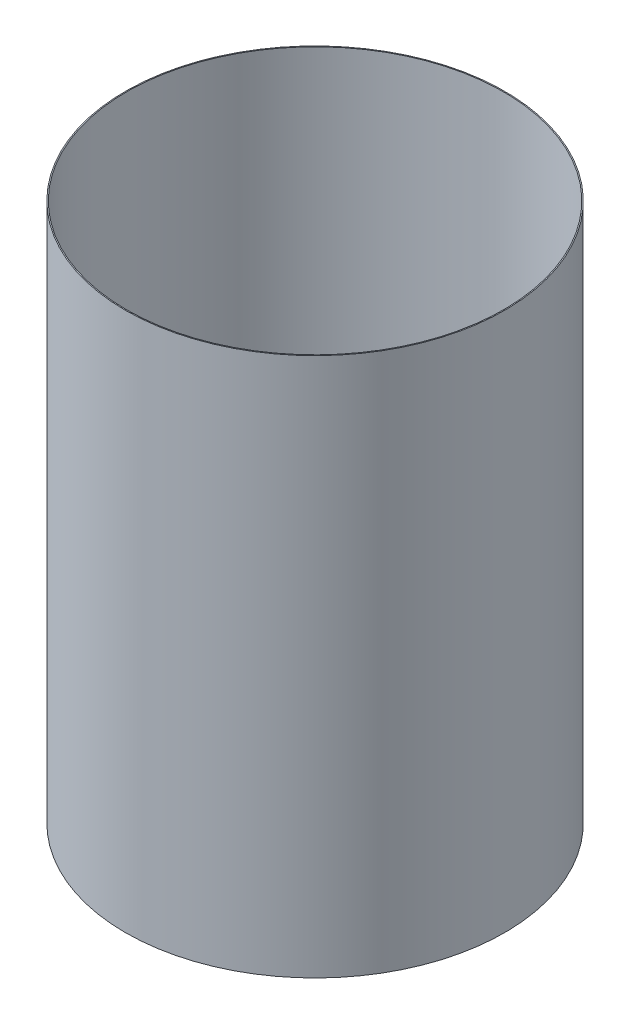
ISO-10303-21;
HEADER;
FILE_DESCRIPTION(('STEP AP214'),'2;1');
FILE_NAME('part.step','',(''),(''),'','','');
FILE_SCHEMA(('AUTOMOTIVE_DESIGN { 1 0 10303 214 1 1 1 1 }'));
ENDSEC;
DATA;
#1=APPLICATION_CONTEXT('core data for automotive mechanical design processes');
#2=APPLICATION_PROTOCOL_DEFINITION('international standard','automotive_design',2000,#1);
#3=PRODUCT_CONTEXT('',#1,'mechanical');
#4=PRODUCT('Part','Part','',(#3));
#5=PRODUCT_RELATED_PRODUCT_CATEGORY('part','',(#4));
#6=PRODUCT_DEFINITION_FORMATION('','',#4);
#7=PRODUCT_DEFINITION_CONTEXT('part definition',#1,'design');
#8=PRODUCT_DEFINITION('design','',#6,#7);
#9=PRODUCT_DEFINITION_SHAPE('','',#8);
#10=(LENGTH_UNIT() NAMED_UNIT(*) SI_UNIT(.MILLI.,.METRE.));
#11=(NAMED_UNIT(*) PLANE_ANGLE_UNIT() SI_UNIT($,.RADIAN.));
#12=(NAMED_UNIT(*) SI_UNIT($,.STERADIAN.) SOLID_ANGLE_UNIT());
#13=UNCERTAINTY_MEASURE_WITH_UNIT(LENGTH_MEASURE(1.E-05),#10,'distance_accuracy_value','');
#14=(GEOMETRIC_REPRESENTATION_CONTEXT(3) GLOBAL_UNCERTAINTY_ASSIGNED_CONTEXT((#13)) GLOBAL_UNIT_ASSIGNED_CONTEXT((#10,
#11,#12)) REPRESENTATION_CONTEXT('',''));
#15=CARTESIAN_POINT('',(0.,0.,0.));
#16=DIRECTION('',(0.,0.,1.));
#17=DIRECTION('',(1.,0.,0.));
#18=AXIS2_PLACEMENT_3D('',#15,#16,#17);
#19=CARTESIAN_POINT('',(0.,55.,0.));
#20=DIRECTION('',(0.,1.,0.));
#21=DIRECTION('',(0.,0.,1.));
#22=AXIS2_PLACEMENT_3D('',#19,#20,#21);
#23=CYLINDRICAL_SURFACE('',#22,46.9265);
#24=CARTESIAN_POINT('',(0.,-153.255914232196,0.));
#25=DIRECTION('',(0.,1.,0.));
#26=DIRECTION('',(0.,0.,1.));
#27=AXIS2_PLACEMENT_3D('',#24,#25,#26);
#28=CIRCLE('',#27,46.9265);
#29=CARTESIAN_POINT('',(0.,-153.255914232196,46.9265));
#30=VERTEX_POINT('',#29);
#31=EDGE_CURVE('E44',#30,#30,#28,.T.);
#32=ORIENTED_EDGE('',*,*,#31,.T.);
#33=EDGE_LOOP('',(#32));
#34=FACE_BOUND('',#33,.T.);
#35=CARTESIAN_POINT('',(0.,-19.905914232196,0.));
#36=DIRECTION('',(0.,1.,0.));
#37=DIRECTION('',(0.,0.,1.));
#38=AXIS2_PLACEMENT_3D('',#35,#36,#37);
#39=CIRCLE('',#38,46.9265);
#40=CARTESIAN_POINT('',(0.,-19.905914232196,46.9265));
#41=VERTEX_POINT('',#40);
#42=EDGE_CURVE('E10',#41,#41,#39,.T.);
#43=ORIENTED_EDGE('',*,*,#42,.F.);
#44=EDGE_LOOP('',(#43));
#45=FACE_BOUND('',#44,.T.);
#46=ADVANCED_FACE('F30',(#34,#45),#23,.T.);
#47=CARTESIAN_POINT('',(-46.9265,-19.905914232196,0.));
#48=DIRECTION('',(0.,-1.,0.));
#49=DIRECTION('',(0.,0.,-1.));
#50=AXIS2_PLACEMENT_3D('',#47,#48,#49);
#51=PLANE('',#50);
#52=CARTESIAN_POINT('',(0.,-19.905914232196,0.));
#53=DIRECTION('',(0.,1.,0.));
#54=DIRECTION('',(0.,0.,1.));
#55=AXIS2_PLACEMENT_3D('',#52,#53,#54);
#56=CIRCLE('',#55,46.6725);
#57=CARTESIAN_POINT('',(0.,-19.905914232196,46.6725));
#58=VERTEX_POINT('',#57);
#59=EDGE_CURVE('E36',#58,#58,#56,.T.);
#60=ORIENTED_EDGE('',*,*,#59,.F.);
#61=EDGE_LOOP('',(#60));
#62=FACE_BOUND('',#61,.T.);
#63=ORIENTED_EDGE('',*,*,#42,.T.);
#64=EDGE_LOOP('',(#63));
#65=FACE_BOUND('',#64,.T.);
#66=ADVANCED_FACE('F60',(#62,#65),#51,.F.);
#67=CARTESIAN_POINT('',(0.,55.,0.));
#68=DIRECTION('',(0.,1.,0.));
#69=DIRECTION('',(0.,0.,1.));
#70=AXIS2_PLACEMENT_3D('',#67,#68,#69);
#71=CYLINDRICAL_SURFACE('',#70,46.6725);
#72=CARTESIAN_POINT('',(0.,-153.255914232196,0.));
#73=DIRECTION('',(0.,1.,0.));
#74=DIRECTION('',(0.,0.,1.));
#75=AXIS2_PLACEMENT_3D('',#72,#73,#74);
#76=CIRCLE('',#75,46.6725);
#77=CARTESIAN_POINT('',(0.,-153.255914232196,46.6725));
#78=VERTEX_POINT('',#77);
#79=EDGE_CURVE('E40',#78,#78,#76,.T.);
#80=ORIENTED_EDGE('',*,*,#79,.F.);
#81=EDGE_LOOP('',(#80));
#82=FACE_BOUND('',#81,.T.);
#83=ORIENTED_EDGE('',*,*,#59,.T.);
#84=EDGE_LOOP('',(#83));
#85=FACE_BOUND('',#84,.T.);
#86=ADVANCED_FACE('F55',(#82,#85),#71,.F.);
#87=CARTESIAN_POINT('',(-46.6725,-153.255914232196,0.));
#88=DIRECTION('',(0.,1.,0.));
#89=DIRECTION('',(0.,0.,1.));
#90=AXIS2_PLACEMENT_3D('',#87,#88,#89);
#91=PLANE('',#90);
#92=ORIENTED_EDGE('',*,*,#31,.F.);
#93=EDGE_LOOP('',(#92));
#94=FACE_BOUND('',#93,.T.);
#95=ORIENTED_EDGE('',*,*,#79,.T.);
#96=EDGE_LOOP('',(#95));
#97=FACE_BOUND('',#96,.T.);
#98=ADVANCED_FACE('F52',(#94,#97),#91,.F.);
#99=CLOSED_SHELL('',(#46,#66,#86,#98));
#100=MANIFOLD_SOLID_BREP('B2',#99);
#101=ADVANCED_BREP_SHAPE_REPRESENTATION('',(#18,#100),#14);
#102=SHAPE_DEFINITION_REPRESENTATION(#9,#101);
ENDSEC;
END-ISO-10303-21;
